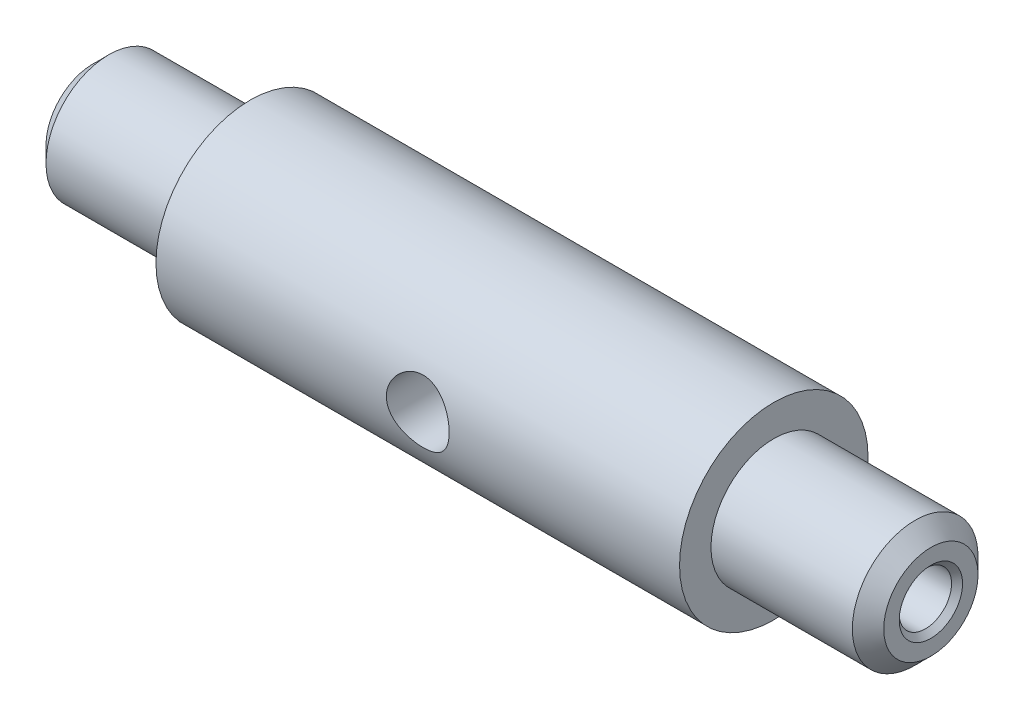
ISO-10303-21;
HEADER;
FILE_DESCRIPTION(('STEP AP214'),'2;1');
FILE_NAME('part.step','',(''),(''),'','','');
FILE_SCHEMA(('AUTOMOTIVE_DESIGN { 1 0 10303 214 1 1 1 1 }'));
ENDSEC;
DATA;
#1=APPLICATION_CONTEXT('core data for automotive mechanical design processes');
#2=APPLICATION_PROTOCOL_DEFINITION('international standard','automotive_design',2000,#1);
#3=PRODUCT_CONTEXT('',#1,'mechanical');
#4=PRODUCT('Part','Part','',(#3));
#5=PRODUCT_RELATED_PRODUCT_CATEGORY('part','',(#4));
#6=PRODUCT_DEFINITION_FORMATION('','',#4);
#7=PRODUCT_DEFINITION_CONTEXT('part definition',#1,'design');
#8=PRODUCT_DEFINITION('design','',#6,#7);
#9=PRODUCT_DEFINITION_SHAPE('','',#8);
#10=(LENGTH_UNIT() NAMED_UNIT(*) SI_UNIT(.MILLI.,.METRE.));
#11=(NAMED_UNIT(*) PLANE_ANGLE_UNIT() SI_UNIT($,.RADIAN.));
#12=(NAMED_UNIT(*) SI_UNIT($,.STERADIAN.) SOLID_ANGLE_UNIT());
#13=UNCERTAINTY_MEASURE_WITH_UNIT(LENGTH_MEASURE(1.E-05),#10,'distance_accuracy_value','');
#14=(GEOMETRIC_REPRESENTATION_CONTEXT(3) GLOBAL_UNCERTAINTY_ASSIGNED_CONTEXT((#13)) GLOBAL_UNIT_ASSIGNED_CONTEXT((#10,
#11,#12)) REPRESENTATION_CONTEXT('',''));
#15=CARTESIAN_POINT('',(0.,0.,0.));
#16=DIRECTION('',(0.,0.,1.));
#17=DIRECTION('',(1.,0.,0.));
#18=AXIS2_PLACEMENT_3D('',#15,#16,#17);
#19=CARTESIAN_POINT('',(0.,0.,-6.));
#20=DIRECTION('',(1.,0.,0.));
#21=DIRECTION('',(0.,0.,-1.));
#22=AXIS2_PLACEMENT_3D('',#19,#20,#21);
#23=PLANE('',#22);
#24=CARTESIAN_POINT('',(0.,0.,0.));
#25=DIRECTION('',(1.,0.,0.));
#26=DIRECTION('',(0.,0.,-1.));
#27=AXIS2_PLACEMENT_3D('',#24,#25,#26);
#28=CIRCLE('',#27,4.5);
#29=CARTESIAN_POINT('',(0.,0.,-4.5));
#30=VERTEX_POINT('',#29);
#31=EDGE_CURVE('E90',#30,#30,#28,.F.);
#32=ORIENTED_EDGE('',*,*,#31,.T.);
#33=EDGE_LOOP('',(#32));
#34=FACE_BOUND('',#33,.T.);
#35=ADVANCED_FACE('F50',(#34),#23,.F.);
#36=CARTESIAN_POINT('',(80.,0.,-6.));
#37=DIRECTION('',(-1.,0.,0.));
#38=DIRECTION('',(0.,0.,1.));
#39=AXIS2_PLACEMENT_3D('',#36,#37,#38);
#40=PLANE('',#39);
#41=CARTESIAN_POINT('',(80.,0.,0.));
#42=DIRECTION('',(-1.,0.,0.));
#43=DIRECTION('',(0.,0.,1.));
#44=AXIS2_PLACEMENT_3D('',#41,#42,#43);
#45=CIRCLE('',#44,4.5);
#46=CARTESIAN_POINT('',(80.,0.,4.5));
#47=VERTEX_POINT('',#46);
#48=EDGE_CURVE('E11',#47,#47,#45,.F.);
#49=ORIENTED_EDGE('',*,*,#48,.T.);
#50=EDGE_LOOP('',(#49));
#51=FACE_BOUND('',#50,.T.);
#52=CARTESIAN_POINT('',(80.,0.,0.));
#53=DIRECTION('',(1.,0.,0.));
#54=DIRECTION('',(0.,0.,-1.));
#55=AXIS2_PLACEMENT_3D('',#52,#53,#54);
#56=CIRCLE('',#55,3.025);
#57=CARTESIAN_POINT('',(80.,0.,-3.025));
#58=VERTEX_POINT('',#57);
#59=EDGE_CURVE('E78',#58,#58,#56,.T.);
#60=ORIENTED_EDGE('',*,*,#59,.F.);
#61=EDGE_LOOP('',(#60));
#62=FACE_BOUND('',#61,.T.);
#63=ADVANCED_FACE('F142',(#51,#62),#40,.F.);
#64=CARTESIAN_POINT('',(0.,0.,0.));
#65=DIRECTION('',(-1.,0.,0.));
#66=DIRECTION('',(0.,0.,1.));
#67=AXIS2_PLACEMENT_3D('',#64,#65,#66);
#68=CYLINDRICAL_SURFACE('',#67,6.);
#69=CARTESIAN_POINT('',(78.5,0.,0.));
#70=DIRECTION('',(-1.,0.,0.));
#71=DIRECTION('',(0.,0.,1.));
#72=AXIS2_PLACEMENT_3D('',#69,#70,#71);
#73=CIRCLE('',#72,6.);
#74=CARTESIAN_POINT('',(78.5,0.,6.));
#75=VERTEX_POINT('',#74);
#76=EDGE_CURVE('E58',#75,#75,#73,.T.);
#77=ORIENTED_EDGE('',*,*,#76,.T.);
#78=EDGE_LOOP('',(#77));
#79=FACE_BOUND('',#78,.T.);
#80=CARTESIAN_POINT('',(65.,0.,0.));
#81=DIRECTION('',(-1.,0.,0.));
#82=DIRECTION('',(0.,0.,1.));
#83=AXIS2_PLACEMENT_3D('',#80,#81,#82);
#84=CIRCLE('',#83,6.);
#85=CARTESIAN_POINT('',(65.,0.,6.));
#86=VERTEX_POINT('',#85);
#87=EDGE_CURVE('E87',#86,#86,#84,.T.);
#88=ORIENTED_EDGE('',*,*,#87,.F.);
#89=EDGE_LOOP('',(#88));
#90=FACE_BOUND('',#89,.T.);
#91=ADVANCED_FACE('F138',(#79,#90),#68,.T.);
#92=CARTESIAN_POINT('',(65.,0.,-9.));
#93=DIRECTION('',(-1.,0.,0.));
#94=DIRECTION('',(0.,0.,1.));
#95=AXIS2_PLACEMENT_3D('',#92,#93,#94);
#96=PLANE('',#95);
#97=CARTESIAN_POINT('',(65.,0.,0.));
#98=DIRECTION('',(-1.,0.,0.));
#99=DIRECTION('',(0.,0.,1.));
#100=AXIS2_PLACEMENT_3D('',#97,#98,#99);
#101=CIRCLE('',#100,9.);
#102=CARTESIAN_POINT('',(65.,0.,9.));
#103=VERTEX_POINT('',#102);
#104=EDGE_CURVE('E84',#103,#103,#101,.T.);
#105=ORIENTED_EDGE('',*,*,#104,.F.);
#106=EDGE_LOOP('',(#105));
#107=FACE_BOUND('',#106,.T.);
#108=ORIENTED_EDGE('',*,*,#87,.T.);
#109=EDGE_LOOP('',(#108));
#110=FACE_BOUND('',#109,.T.);
#111=ADVANCED_FACE('F132',(#107,#110),#96,.F.);
#112=CARTESIAN_POINT('',(0.,0.,0.));
#113=DIRECTION('',(-1.,0.,0.));
#114=DIRECTION('',(0.,0.,1.));
#115=AXIS2_PLACEMENT_3D('',#112,#113,#114);
#116=CYLINDRICAL_SURFACE('',#115,9.);
#117=CARTESIAN_POINT('',(43.,0.,-9.));
#118=CARTESIAN_POINT('',(43.0000007611949,0.16369008866017,-9.00000045902832));
#119=CARTESIAN_POINT('',(42.9865592016184,0.32737558361565,-8.99549308522634));
#120=CARTESIAN_POINT('',(42.9333126735484,0.649925282618917,-8.97795630609842));
#121=CARTESIAN_POINT('',(42.8935049681532,0.808788984356454,-8.96492601606458));
#122=CARTESIAN_POINT('',(42.7890422698479,1.11699836850533,-8.93175923719328));
#123=CARTESIAN_POINT('',(42.7244288126222,1.2663594776581,-8.9116346319256));
#124=CARTESIAN_POINT('',(42.572376481485,1.55212481041597,-8.86633337152025));
#125=CARTESIAN_POINT('',(42.4849331049922,1.68852647087612,-8.84115572003334));
#126=CARTESIAN_POINT('',(42.2865225854237,1.9492250250668,-8.78742283329015));
#127=CARTESIAN_POINT('',(42.1749062972185,2.07301110089493,-8.75878669391354));
#128=CARTESIAN_POINT('',(41.9326985358803,2.30049807810626,-8.70180944349364));
#129=CARTESIAN_POINT('',(41.8021028952145,2.40419455646839,-8.67346839871647));
#130=CARTESIAN_POINT('',(41.5210446544106,2.59147482668358,-8.61939997431821));
#131=CARTESIAN_POINT('',(41.3701187808036,2.6743945746631,-8.59377117827064));
#132=CARTESIAN_POINT('',(41.0554717166244,2.81345662163316,-8.54925916255803));
#133=CARTESIAN_POINT('',(40.8917544485118,2.8696070921603,-8.53037388482237));
#134=CARTESIAN_POINT('',(40.5619803355099,2.95162038452749,-8.50233909808132));
#135=CARTESIAN_POINT('',(40.3961883745328,2.97844034481531,-8.49288287308834));
#136=CARTESIAN_POINT('',(40.0622087375324,3.00402337000343,-8.48386969888522));
#137=CARTESIAN_POINT('',(39.8940218178724,3.00279510481416,-8.4843096906819));
#138=CARTESIAN_POINT('',(39.5681901086679,2.97305971111026,-8.4947704502454));
#139=CARTESIAN_POINT('',(39.4104147912429,2.94580173950099,-8.50435247602599));
#140=CARTESIAN_POINT('',(39.1018197411795,2.86681848854825,-8.53129973173653));
#141=CARTESIAN_POINT('',(38.9510008436948,2.81509027977562,-8.54866589352322));
#142=CARTESIAN_POINT('',(38.6577617512256,2.68781717418063,-8.58953733393746));
#143=CARTESIAN_POINT('',(38.5155159235914,2.61190214612179,-8.61313697379352));
#144=CARTESIAN_POINT('',(38.2453872751608,2.43866731890942,-8.66377675727179));
#145=CARTESIAN_POINT('',(38.1175086191999,2.34134133709202,-8.69081789371391));
#146=CARTESIAN_POINT('',(37.8727252055177,2.12204799804671,-8.74701987503222));
#147=CARTESIAN_POINT('',(37.7567419164728,1.99905945022893,-8.77621768064528));
#148=CARTESIAN_POINT('',(37.5468062000098,1.73501870991019,-8.8322081516111));
#149=CARTESIAN_POINT('',(37.4528558855065,1.59396478698244,-8.85900058614202));
#150=CARTESIAN_POINT('',(37.2889110992948,1.29584283913881,-8.90751323813381));
#151=CARTESIAN_POINT('',(37.2191635259778,1.13862982924901,-8.92918050024118));
#152=CARTESIAN_POINT('',(37.1073904781329,0.813807250093526,-8.96461701433304));
#153=CARTESIAN_POINT('',(37.0653553737297,0.646201314464864,-8.97838900964638));
#154=CARTESIAN_POINT('',(37.0118330019329,0.313151488587914,-8.99602881214321));
#155=CARTESIAN_POINT('',(36.9991005724817,0.14792879959454,-9.00030005501184));
#156=CARTESIAN_POINT('',(37.0009980207954,-0.182325209880712,-8.99966708084482));
#157=CARTESIAN_POINT('',(37.0156232799396,-0.347356557958952,-8.99476441258087));
#158=CARTESIAN_POINT('',(37.0708357232079,-0.667559598912768,-8.97660074151313));
#159=CARTESIAN_POINT('',(37.1106586181485,-0.822878420504531,-8.96358596133577));
#160=CARTESIAN_POINT('',(37.2141803334002,-1.12456787573872,-8.9307554049021));
#161=CARTESIAN_POINT('',(37.2778821984034,-1.27093736552582,-8.91093876140025));
#162=CARTESIAN_POINT('',(37.4292112955224,-1.55486488917982,-8.86586793861869));
#163=CARTESIAN_POINT('',(37.5174237798495,-1.69208987765144,-8.84048444267358));
#164=CARTESIAN_POINT('',(37.7145824500405,-1.95019449040676,-8.78715761748787));
#165=CARTESIAN_POINT('',(37.8235349680953,-2.07106910338673,-8.75921350781483));
#166=CARTESIAN_POINT('',(38.0649362530198,-2.2987575234189,-8.70230543941334));
#167=CARTESIAN_POINT('',(38.1982276807806,-2.40468290773731,-8.67335283262284));
#168=CARTESIAN_POINT('',(38.4813147034327,-2.59277256697072,-8.61899919884126));
#169=CARTESIAN_POINT('',(38.6311104359022,-2.67493664379304,-8.59359820146007));
#170=CARTESIAN_POINT('',(38.9430190458697,-2.81279079124909,-8.54947175374151));
#171=CARTESIAN_POINT('',(39.1051062375063,-2.86853439649507,-8.53073282378936));
#172=CARTESIAN_POINT('',(39.4371359501324,-2.95168400027807,-8.50232496919349));
#173=CARTESIAN_POINT('',(39.607074896213,-2.97910276486182,-8.49265195870918));
#174=CARTESIAN_POINT('',(39.9405912881227,-3.00382884743203,-8.48393576622531));
#175=CARTESIAN_POINT('',(40.1040470208605,-3.0026107719252,-8.48437200772245));
#176=CARTESIAN_POINT('',(40.4282952247662,-2.97372688034608,-8.49453809471602));
#177=CARTESIAN_POINT('',(40.5890878538653,-2.94606263837576,-8.50426738708085));
#178=CARTESIAN_POINT('',(40.9004069890074,-2.86611543938804,-8.53153572914675));
#179=CARTESIAN_POINT('',(41.0510704750135,-2.81431003804654,-8.54892294067433));
#180=CARTESIAN_POINT('',(41.3416822208148,-2.68793809727924,-8.58949196455405));
#181=CARTESIAN_POINT('',(41.481628093564,-2.61336650566142,-8.61267506290179));
#182=CARTESIAN_POINT('',(41.7534510097687,-2.43978207775029,-8.66348487678138));
#183=CARTESIAN_POINT('',(41.8847095056952,-2.33984472829374,-8.69126134926411));
#184=CARTESIAN_POINT('',(42.1290694401526,-2.11992864940694,-8.74750068849759));
#185=CARTESIAN_POINT('',(42.2421657270642,-1.99994425335444,-8.77596374737117));
#186=CARTESIAN_POINT('',(42.4514332368675,-1.73772467076207,-8.83170091576632));
#187=CARTESIAN_POINT('',(42.546773043253,-1.59480454049919,-8.8588854540377));
#188=CARTESIAN_POINT('',(42.7119712865519,-1.29407207221988,-8.90777973517836));
#189=CARTESIAN_POINT('',(42.7818362377661,-1.13626355439705,-8.92949087723789));
#190=CARTESIAN_POINT('',(42.891164897466,-0.817480941602931,-8.96416545205625));
#191=CARTESIAN_POINT('',(42.9318473987901,-0.656963273029229,-8.97747637267568));
#192=CARTESIAN_POINT('',(42.9862608420314,-0.330961248030742,-8.99539221192665));
#193=CARTESIAN_POINT('',(42.9999992304896,-0.16547827670624,-8.99999953595715));
#194=CARTESIAN_POINT('',(43.,0.,-9.));
#195=B_SPLINE_CURVE_WITH_KNOTS('',3,(#117,#118,#119,#120,#121,#122,#123,#124,#125,#126,#127,
#128,#129,#130,#131,#132,#133,#134,#135,#136,#137,#138,#139,#140,#141,#142,#143,#144,#145,#146,
#147,#148,#149,#150,#151,#152,#153,#154,#155,#156,#157,#158,#159,#160,#161,#162,#163,#164,#165,
#166,#167,#168,#169,#170,#171,#172,#173,#174,#175,#176,#177,#178,#179,#180,#181,#182,#183,#184,
#185,#186,#187,#188,#189,#190,#191,#192,#193,#194),.UNSPECIFIED.,.T.,.F.,(4,2,2,2,2,2,2,2,2,2,2,
2,2,2,2,2,2,2,2,2,2,2,2,2,2,2,2,2,2,2,2,2,2,2,2,2,2,2,4),(0.,0.490461318078033,
0.980973555802562,1.47066801861082,1.9604591333973,2.46554052848269,2.97073299862591,
3.49045154470411,4.010011340785,4.51205777225521,5.01394901962457,5.49290479653841,
5.97191792566446,6.45864513465392,6.94551307674622,7.45779917434101,7.97013437899855,
8.48755216951072,9.00479006631625,9.49960749525509,9.9943413949253,10.4747447393464,
10.9552093585231,11.4483119953121,11.9415654246567,12.4572306864226,12.9729002470499,
13.4875204148031,14.0019085411752,14.4898699819277,14.9778023805413,15.4564676124125,
15.9352391452793,16.4349020007541,16.9347063337134,17.453989825053,17.9731404345737,
18.4690967512144,18.9649159811442),.UNSPECIFIED.);
#196=CARTESIAN_POINT('',(43.,0.,-9.));
#197=VERTEX_POINT('',#196);
#198=EDGE_CURVE('E122',#197,#197,#195,.T.);
#199=ORIENTED_EDGE('',*,*,#198,.T.);
#200=EDGE_LOOP('',(#199));
#201=FACE_BOUND('',#200,.T.);
#202=CARTESIAN_POINT('',(43.,0.,9.));
#203=CARTESIAN_POINT('',(43.0000007611949,-0.16369008866017,9.00000045902832));
#204=CARTESIAN_POINT('',(42.9865592016184,-0.32737558361565,8.99549308522634));
#205=CARTESIAN_POINT('',(42.9333126735484,-0.649925282618917,8.97795630609842));
#206=CARTESIAN_POINT('',(42.8935049681532,-0.808788984356454,8.96492601606458));
#207=CARTESIAN_POINT('',(42.7890422698479,-1.11699836850533,8.93175923719328));
#208=CARTESIAN_POINT('',(42.7244288126222,-1.2663594776581,8.9116346319256));
#209=CARTESIAN_POINT('',(42.572376481485,-1.55212481041597,8.86633337152025));
#210=CARTESIAN_POINT('',(42.4849331049922,-1.68852647087612,8.84115572003334));
#211=CARTESIAN_POINT('',(42.2865225854237,-1.9492250250668,8.78742283329015));
#212=CARTESIAN_POINT('',(42.1749062972185,-2.07301110089493,8.75878669391354));
#213=CARTESIAN_POINT('',(41.9326985358803,-2.30049807810626,8.70180944349364));
#214=CARTESIAN_POINT('',(41.8021028952145,-2.40419455646839,8.67346839871647));
#215=CARTESIAN_POINT('',(41.5210446544106,-2.59147482668358,8.61939997431821));
#216=CARTESIAN_POINT('',(41.3701187808036,-2.6743945746631,8.59377117827064));
#217=CARTESIAN_POINT('',(41.0554717166244,-2.81345662163316,8.54925916255803));
#218=CARTESIAN_POINT('',(40.8917544485118,-2.8696070921603,8.53037388482237));
#219=CARTESIAN_POINT('',(40.5619803355099,-2.95162038452749,8.50233909808132));
#220=CARTESIAN_POINT('',(40.3961883745328,-2.97844034481531,8.49288287308834));
#221=CARTESIAN_POINT('',(40.0622087375324,-3.00402337000343,8.48386969888522));
#222=CARTESIAN_POINT('',(39.8940218178724,-3.00279510481416,8.4843096906819));
#223=CARTESIAN_POINT('',(39.5681901086679,-2.97305971111026,8.4947704502454));
#224=CARTESIAN_POINT('',(39.4104147912429,-2.94580173950099,8.50435247602599));
#225=CARTESIAN_POINT('',(39.1018197411795,-2.86681848854825,8.53129973173653));
#226=CARTESIAN_POINT('',(38.9510008436948,-2.81509027977562,8.54866589352322));
#227=CARTESIAN_POINT('',(38.6577617512256,-2.68781717418063,8.58953733393746));
#228=CARTESIAN_POINT('',(38.5155159235914,-2.61190214612179,8.61313697379352));
#229=CARTESIAN_POINT('',(38.2453872751608,-2.43866731890942,8.66377675727179));
#230=CARTESIAN_POINT('',(38.1175086191999,-2.34134133709202,8.69081789371391));
#231=CARTESIAN_POINT('',(37.8727252055177,-2.12204799804671,8.74701987503222));
#232=CARTESIAN_POINT('',(37.7567419164728,-1.99905945022893,8.77621768064528));
#233=CARTESIAN_POINT('',(37.5468062000098,-1.73501870991019,8.8322081516111));
#234=CARTESIAN_POINT('',(37.4528558855065,-1.59396478698244,8.85900058614202));
#235=CARTESIAN_POINT('',(37.2889110992948,-1.29584283913881,8.90751323813381));
#236=CARTESIAN_POINT('',(37.2191635259778,-1.13862982924901,8.92918050024118));
#237=CARTESIAN_POINT('',(37.1073904781329,-0.813807250093526,8.96461701433304));
#238=CARTESIAN_POINT('',(37.0653553737297,-0.646201314464864,8.97838900964638));
#239=CARTESIAN_POINT('',(37.0118330019329,-0.313151488587914,8.99602881214321));
#240=CARTESIAN_POINT('',(36.9991005724817,-0.14792879959454,9.00030005501184));
#241=CARTESIAN_POINT('',(37.0009980207954,0.182325209880712,8.99966708084482));
#242=CARTESIAN_POINT('',(37.0156232799396,0.347356557958952,8.99476441258087));
#243=CARTESIAN_POINT('',(37.0708357232079,0.667559598912768,8.97660074151313));
#244=CARTESIAN_POINT('',(37.1106586181485,0.822878420504531,8.96358596133577));
#245=CARTESIAN_POINT('',(37.2141803334002,1.12456787573872,8.9307554049021));
#246=CARTESIAN_POINT('',(37.2778821984034,1.27093736552582,8.91093876140025));
#247=CARTESIAN_POINT('',(37.4292112955224,1.55486488917982,8.86586793861869));
#248=CARTESIAN_POINT('',(37.5174237798495,1.69208987765144,8.84048444267358));
#249=CARTESIAN_POINT('',(37.7145824500405,1.95019449040676,8.78715761748787));
#250=CARTESIAN_POINT('',(37.8235349680953,2.07106910338673,8.75921350781483));
#251=CARTESIAN_POINT('',(38.0649362530198,2.2987575234189,8.70230543941334));
#252=CARTESIAN_POINT('',(38.1982276807806,2.40468290773731,8.67335283262284));
#253=CARTESIAN_POINT('',(38.4813147034327,2.59277256697072,8.61899919884126));
#254=CARTESIAN_POINT('',(38.6311104359022,2.67493664379304,8.59359820146007));
#255=CARTESIAN_POINT('',(38.9430190458697,2.81279079124909,8.54947175374151));
#256=CARTESIAN_POINT('',(39.1051062375063,2.86853439649507,8.53073282378936));
#257=CARTESIAN_POINT('',(39.4371359501324,2.95168400027807,8.50232496919349));
#258=CARTESIAN_POINT('',(39.607074896213,2.97910276486182,8.49265195870918));
#259=CARTESIAN_POINT('',(39.9405912881227,3.00382884743203,8.48393576622531));
#260=CARTESIAN_POINT('',(40.1040470208605,3.0026107719252,8.48437200772245));
#261=CARTESIAN_POINT('',(40.4282952247662,2.97372688034608,8.49453809471602));
#262=CARTESIAN_POINT('',(40.5890878538653,2.94606263837576,8.50426738708085));
#263=CARTESIAN_POINT('',(40.9004069890074,2.86611543938804,8.53153572914675));
#264=CARTESIAN_POINT('',(41.0510704750135,2.81431003804654,8.54892294067433));
#265=CARTESIAN_POINT('',(41.3416822208148,2.68793809727924,8.58949196455405));
#266=CARTESIAN_POINT('',(41.481628093564,2.61336650566142,8.61267506290179));
#267=CARTESIAN_POINT('',(41.7534510097687,2.43978207775029,8.66348487678138));
#268=CARTESIAN_POINT('',(41.8847095056952,2.33984472829374,8.69126134926411));
#269=CARTESIAN_POINT('',(42.1290694401526,2.11992864940694,8.74750068849759));
#270=CARTESIAN_POINT('',(42.2421657270642,1.99994425335444,8.77596374737117));
#271=CARTESIAN_POINT('',(42.4514332368675,1.73772467076207,8.83170091576632));
#272=CARTESIAN_POINT('',(42.546773043253,1.59480454049919,8.8588854540377));
#273=CARTESIAN_POINT('',(42.7119712865519,1.29407207221988,8.90777973517836));
#274=CARTESIAN_POINT('',(42.7818362377661,1.13626355439705,8.92949087723789));
#275=CARTESIAN_POINT('',(42.891164897466,0.817480941602931,8.96416545205625));
#276=CARTESIAN_POINT('',(42.9318473987901,0.656963273029229,8.97747637267568));
#277=CARTESIAN_POINT('',(42.9862608420314,0.330961248030742,8.99539221192665));
#278=CARTESIAN_POINT('',(42.9999992304896,0.16547827670624,8.99999953595715));
#279=CARTESIAN_POINT('',(43.,0.,9.));
#280=B_SPLINE_CURVE_WITH_KNOTS('',3,(#202,#203,#204,#205,#206,#207,#208,#209,#210,#211,#212,
#213,#214,#215,#216,#217,#218,#219,#220,#221,#222,#223,#224,#225,#226,#227,#228,#229,#230,#231,
#232,#233,#234,#235,#236,#237,#238,#239,#240,#241,#242,#243,#244,#245,#246,#247,#248,#249,#250,
#251,#252,#253,#254,#255,#256,#257,#258,#259,#260,#261,#262,#263,#264,#265,#266,#267,#268,#269,
#270,#271,#272,#273,#274,#275,#276,#277,#278,#279),.UNSPECIFIED.,.T.,.F.,(4,2,2,2,2,2,2,2,2,2,2,
2,2,2,2,2,2,2,2,2,2,2,2,2,2,2,2,2,2,2,2,2,2,2,2,2,2,2,4),(0.,0.490461318078033,
0.980973555802562,1.47066801861082,1.9604591333973,2.46554052848269,2.97073299862591,
3.49045154470411,4.010011340785,4.51205777225521,5.01394901962457,5.49290479653841,
5.97191792566446,6.45864513465392,6.94551307674622,7.45779917434101,7.97013437899855,
8.48755216951072,9.00479006631625,9.49960749525509,9.9943413949253,10.4747447393464,
10.9552093585231,11.4483119953121,11.9415654246567,12.4572306864226,12.9729002470499,
13.4875204148031,14.0019085411752,14.4898699819277,14.9778023805413,15.4564676124125,
15.9352391452793,16.4349020007541,16.9347063337134,17.453989825053,17.9731404345737,
18.4690967512144,18.9649159811442),.UNSPECIFIED.);
#281=CARTESIAN_POINT('',(43.,0.,9.));
#282=VERTEX_POINT('',#281);
#283=EDGE_CURVE('E116',#282,#282,#280,.T.);
#284=ORIENTED_EDGE('',*,*,#283,.T.);
#285=EDGE_LOOP('',(#284));
#286=FACE_BOUND('',#285,.T.);
#287=CARTESIAN_POINT('',(15.,0.,0.));
#288=DIRECTION('',(-1.,0.,0.));
#289=DIRECTION('',(0.,0.,1.));
#290=AXIS2_PLACEMENT_3D('',#287,#288,#289);
#291=CIRCLE('',#290,9.);
#292=CARTESIAN_POINT('',(15.,0.,9.));
#293=VERTEX_POINT('',#292);
#294=EDGE_CURVE('E75',#293,#293,#291,.T.);
#295=ORIENTED_EDGE('',*,*,#294,.F.);
#296=EDGE_LOOP('',(#295));
#297=FACE_BOUND('',#296,.T.);
#298=ORIENTED_EDGE('',*,*,#104,.T.);
#299=EDGE_LOOP('',(#298));
#300=FACE_BOUND('',#299,.T.);
#301=ADVANCED_FACE('F126',(#201,#286,#297,#300),#116,.T.);
#302=CARTESIAN_POINT('',(15.,0.,-6.));
#303=DIRECTION('',(1.,0.,0.));
#304=DIRECTION('',(0.,0.,-1.));
#305=AXIS2_PLACEMENT_3D('',#302,#303,#304);
#306=PLANE('',#305);
#307=CARTESIAN_POINT('',(15.,0.,0.));
#308=DIRECTION('',(-1.,0.,0.));
#309=DIRECTION('',(0.,0.,1.));
#310=AXIS2_PLACEMENT_3D('',#307,#308,#309);
#311=CIRCLE('',#310,6.);
#312=CARTESIAN_POINT('',(15.,0.,6.));
#313=VERTEX_POINT('',#312);
#314=EDGE_CURVE('E71',#313,#313,#311,.T.);
#315=ORIENTED_EDGE('',*,*,#314,.F.);
#316=EDGE_LOOP('',(#315));
#317=FACE_BOUND('',#316,.T.);
#318=ORIENTED_EDGE('',*,*,#294,.T.);
#319=EDGE_LOOP('',(#318));
#320=FACE_BOUND('',#319,.T.);
#321=ADVANCED_FACE('F131',(#317,#320),#306,.F.);
#322=CARTESIAN_POINT('',(0.,0.,0.));
#323=DIRECTION('',(-1.,0.,0.));
#324=DIRECTION('',(0.,0.,1.));
#325=AXIS2_PLACEMENT_3D('',#322,#323,#324);
#326=CYLINDRICAL_SURFACE('',#325,6.);
#327=CARTESIAN_POINT('',(1.50000000000002,0.,0.));
#328=DIRECTION('',(1.,0.,0.));
#329=DIRECTION('',(0.,0.,-1.));
#330=AXIS2_PLACEMENT_3D('',#327,#328,#329);
#331=CIRCLE('',#330,6.);
#332=CARTESIAN_POINT('',(1.50000000000002,0.,-6.));
#333=VERTEX_POINT('',#332);
#334=EDGE_CURVE('E164',#333,#333,#331,.T.);
#335=ORIENTED_EDGE('',*,*,#334,.T.);
#336=EDGE_LOOP('',(#335));
#337=FACE_BOUND('',#336,.T.);
#338=ORIENTED_EDGE('',*,*,#314,.T.);
#339=EDGE_LOOP('',(#338));
#340=FACE_BOUND('',#339,.T.);
#341=ADVANCED_FACE('F175',(#337,#340),#326,.T.);
#342=CARTESIAN_POINT('',(80.,0.,0.));
#343=DIRECTION('',(1.,0.,0.));
#344=DIRECTION('',(0.,0.,-1.));
#345=AXIS2_PLACEMENT_3D('',#342,#343,#344);
#346=CYLINDRICAL_SURFACE('',#345,2.5);
#347=CARTESIAN_POINT('',(43.,0.,-2.5));
#348=CARTESIAN_POINT('',(42.9999952279521,-0.118757533193203,-2.49999511444631));
#349=CARTESIAN_POINT('',(42.9928867059474,-0.237551281104127,-2.49147749609542));
#350=CARTESIAN_POINT('',(42.9651076286827,-0.47118249249281,-2.45803727664816));
#351=CARTESIAN_POINT('',(42.9444270294201,-0.586016959612417,-2.43310252602469));
#352=CARTESIAN_POINT('',(42.8914269023887,-0.807829942407296,-2.36868788266729));
#353=CARTESIAN_POINT('',(42.8591769655007,-0.914850920904899,-2.32929492564628));
#354=CARTESIAN_POINT('',(42.785291761829,-1.11984139043408,-2.23798295205742));
#355=CARTESIAN_POINT('',(42.7436533243494,-1.21780780775233,-2.18605970332675));
#356=CARTESIAN_POINT('',(42.6367419152987,-1.43789998519767,-2.05054625019184));
#357=CARTESIAN_POINT('',(42.5684054925619,-1.5556821965722,-1.96232979581782));
#358=CARTESIAN_POINT('',(42.4242262477767,-1.77202398328146,-1.76947567424863));
#359=CARTESIAN_POINT('',(42.3483628145328,-1.87052845158604,-1.66479243075689));
#360=CARTESIAN_POINT('',(42.2329488631374,-2.00437263805588,-1.4959157235089));
#361=CARTESIAN_POINT('',(42.19383679995,-2.04699726278815,-1.43704442380869));
#362=CARTESIAN_POINT('',(42.1162061180919,-2.12715295529554,-1.31549439703949));
#363=CARTESIAN_POINT('',(42.0776877019502,-2.16468231743739,-1.25281440512925));
#364=CARTESIAN_POINT('',(42.0025054328866,-2.23441122570746,-1.12373267566438));
#365=CARTESIAN_POINT('',(41.9658373575465,-2.26662332666226,-1.05734021527518));
#366=CARTESIAN_POINT('',(41.8957768663031,-2.32553690612792,-0.920553716071604));
#367=CARTESIAN_POINT('',(41.862381672209,-2.3522430799868,-0.850163152658202));
#368=CARTESIAN_POINT('',(41.7979191898041,-2.40193513934005,-0.698332909799898));
#369=CARTESIAN_POINT('',(41.76736311251,-2.42433807692598,-0.616475907276517));
#370=CARTESIAN_POINT('',(41.71593180556,-2.46101313675502,-0.448110231186896));
#371=CARTESIAN_POINT('',(41.695033101942,-2.47530499393792,-0.361613413385324));
#372=CARTESIAN_POINT('',(41.6662092896885,-2.49481072799047,-0.184234591620543));
#373=CARTESIAN_POINT('',(41.6584451056309,-2.49991205058667,-0.0933120409293055));
#374=CARTESIAN_POINT('',(41.6581830853183,-2.50008569371189,0.0885626130027642));
#375=CARTESIAN_POINT('',(41.6656854491694,-2.49515788278404,0.179514716615338));
#376=CARTESIAN_POINT('',(41.695416394645,-2.47505262029594,0.365524710827123));
#377=CARTESIAN_POINT('',(41.7188193206647,-2.45905577113331,0.460293745717067));
#378=CARTESIAN_POINT('',(41.7768823573891,-2.41742550503026,0.644210981202177));
#379=CARTESIAN_POINT('',(41.8115797710303,-2.39176011044289,0.733339370714825));
#380=CARTESIAN_POINT('',(41.8800222612614,-2.33816270346872,0.887827078541109));
#381=CARTESIAN_POINT('',(41.9125031684544,-2.31177513033565,0.95431224241166));
#382=CARTESIAN_POINT('',(41.9802199666153,-2.25404424958635,1.08365080677994));
#383=CARTESIAN_POINT('',(42.0154574669779,-2.22269803586305,1.14650204786585));
#384=CARTESIAN_POINT('',(42.1234264810973,-2.12149677560465,1.32996684101968));
#385=CARTESIAN_POINT('',(42.1983769696744,-2.04450664231775,1.44541414760609));
#386=CARTESIAN_POINT('',(42.3507989795228,-1.86765914501413,1.66826696245436));
#387=CARTESIAN_POINT('',(42.4281979261895,-1.76681805277627,1.77493832399189));
#388=CARTESIAN_POINT('',(42.5750905404329,-1.54484388336147,1.97111234481741));
#389=CARTESIAN_POINT('',(42.6446011226737,-1.42375565615771,2.06065203305627));
#390=CARTESIAN_POINT('',(42.7542891412655,-1.19411179169414,2.19941483909855));
#391=CARTESIAN_POINT('',(42.79748350074,-1.08972732107275,2.25314289818765));
#392=CARTESIAN_POINT('',(42.873078040198,-0.871071458330349,2.34634274525534));
#393=CARTESIAN_POINT('',(42.9054849566081,-0.756806292780747,2.38582343158057));
#394=CARTESIAN_POINT('',(42.9570983426557,-0.519954301215404,2.4484172499322));
#395=CARTESIAN_POINT('',(42.9762028095584,-0.397310923125295,2.47140394665756));
#396=CARTESIAN_POINT('',(42.9989143452897,-0.148559976923715,2.49870923192718));
#397=CARTESIAN_POINT('',(43.0025317830418,-0.0224547835239901,2.50304031085015));
#398=CARTESIAN_POINT('',(42.9944499903915,0.213310199456585,2.49333756055623));
#399=CARTESIAN_POINT('',(42.9845335071631,0.323130540835869,2.48144136128483));
#400=CARTESIAN_POINT('',(42.9532558946014,0.538644964400614,2.4437330497885));
#401=CARTESIAN_POINT('',(42.931893392428,0.64433854998957,2.41791926828103));
#402=CARTESIAN_POINT('',(42.8788952154619,0.850565499199264,2.35337660454474));
#403=CARTESIAN_POINT('',(42.8471256489197,0.951010682223324,2.31447921055572));
#404=CARTESIAN_POINT('',(42.7753612473389,1.14365900898104,2.22560436766329));
#405=CARTESIAN_POINT('',(42.7353633722181,1.23585908831211,2.1756228230067));
#406=CARTESIAN_POINT('',(42.6297515215859,1.450674397351,2.04156820465302));
#407=CARTESIAN_POINT('',(42.5607024423471,1.56834359540732,1.95226741673268));
#408=CARTESIAN_POINT('',(42.4152244540319,1.78428994740848,1.75715961734435));
#409=CARTESIAN_POINT('',(42.3387730042283,1.88250490855173,1.65130154464524));
#410=CARTESIAN_POINT('',(42.222698055986,2.01573314784291,1.48058803207137));
#411=CARTESIAN_POINT('',(42.1834115173603,2.05811069143949,1.421101727024));
#412=CARTESIAN_POINT('',(42.1055315381718,2.13771669597406,1.29827918396771));
#413=CARTESIAN_POINT('',(42.0669383513361,2.17494330406755,1.23494157233589));
#414=CARTESIAN_POINT('',(41.9917610848264,2.24398857026758,1.10451159608479));
#415=CARTESIAN_POINT('',(41.9551718863421,2.27582148781538,1.03742977546638));
#416=CARTESIAN_POINT('',(41.8854756144818,2.3338885673946,0.899209895500154));
#417=CARTESIAN_POINT('',(41.8523653645079,2.36012785984655,0.828075629580612));
#418=CARTESIAN_POINT('',(41.7892555741605,2.40837357148322,0.675729631648096));
#419=CARTESIAN_POINT('',(41.7597071178665,2.42988314318544,0.594165548926257));
#420=CARTESIAN_POINT('',(41.7104306388743,2.46482255689514,0.426548046057378));
#421=CARTESIAN_POINT('',(41.6906781122526,2.47827257713356,0.340506428672104));
#422=CARTESIAN_POINT('',(41.6641531597946,2.49617289535263,0.164362392587653));
#423=CARTESIAN_POINT('',(41.6575325104839,2.5005179918396,0.0742246702492974));
#424=CARTESIAN_POINT('',(41.6592430863067,2.49938197104455,-0.105853212783953));
#425=CARTESIAN_POINT('',(41.6675782540216,2.49389826274011,-0.195793315125153));
#426=CARTESIAN_POINT('',(41.6989289873552,2.4726526384854,-0.381672575390537));
#427=CARTESIAN_POINT('',(41.7234137102386,2.4558581255076,-0.477230270532696));
#428=CARTESIAN_POINT('',(41.7835872803739,2.4125033967509,-0.662531296082725));
#429=CARTESIAN_POINT('',(41.8193131253133,2.38591088285908,-0.752254228709316));
#430=CARTESIAN_POINT('',(41.889526193662,2.33050835844918,-0.907789041354861));
#431=CARTESIAN_POINT('',(41.9227781662779,2.3032585304953,-0.974743759234942));
#432=CARTESIAN_POINT('',(41.9919518523057,2.24370627018011,-1.10494638642442));
#433=CARTESIAN_POINT('',(42.0278751115052,2.21140090020862,-1.16819211099984));
#434=CARTESIAN_POINT('',(42.1377593116791,2.10716294428983,-1.35272956134198));
#435=CARTESIAN_POINT('',(42.2137978016432,2.02793576743749,-1.46874692499196));
#436=CARTESIAN_POINT('',(42.3677260376355,1.84629697567411,-1.69200726129127));
#437=CARTESIAN_POINT('',(42.4455239442951,1.74293959593278,-1.79854179403294));
#438=CARTESIAN_POINT('',(42.5925649842776,1.51553554935618,-1.99386379953936));
#439=CARTESIAN_POINT('',(42.6618269254307,1.39153583663212,-2.08269056587397));
#440=CARTESIAN_POINT('',(42.7694230578151,1.1585551814108,-2.21831419672311));
#441=CARTESIAN_POINT('',(42.8111217400688,1.0539987794769,-2.27003851021945));
#442=CARTESIAN_POINT('',(42.8836146066645,0.835439786054323,-2.35921867023858));
#443=CARTESIAN_POINT('',(42.9144233132377,0.72145002675387,-2.3966935240953));
#444=CARTESIAN_POINT('',(42.9585874590469,0.506620038886831,-2.45018845582659));
#445=CARTESIAN_POINT('',(42.9740214239811,0.406845468761902,-2.46877512222677));
#446=CARTESIAN_POINT('',(42.9947292279441,0.204722725654226,-2.49368236823808));
#447=CARTESIAN_POINT('',(43.0000041137394,0.102374818922779,-2.50000421158692));
#448=CARTESIAN_POINT('',(43.,0.,-2.5));
#449=B_SPLINE_CURVE_WITH_KNOTS('',3,(#347,#348,#349,#350,#351,#352,#353,#354,#355,#356,#357,
#358,#359,#360,#361,#362,#363,#364,#365,#366,#367,#368,#369,#370,#371,#372,#373,#374,#375,#376,
#377,#378,#379,#380,#381,#382,#383,#384,#385,#386,#387,#388,#389,#390,#391,#392,#393,#394,#395,
#396,#397,#398,#399,#400,#401,#402,#403,#404,#405,#406,#407,#408,#409,#410,#411,#412,#413,#414,
#415,#416,#417,#418,#419,#420,#421,#422,#423,#424,#425,#426,#427,#428,#429,#430,#431,#432,#433,
#434,#435,#436,#437,#438,#439,#440,#441,#442,#443,#444,#445,#446,#447,#448),.UNSPECIFIED.,.T.,
.F.,(4,2,2,2,2,2,2,2,2,2,2,2,2,2,2,2,2,2,2,2,2,2,2,2,2,2,2,2,2,2,2,2,2,2,2,2,2,2,2,2,2,2,2,2,2,
2,2,2,2,2,4),(0.,0.355841276815113,0.71194619102696,1.0659440535955,1.42006164830116,
1.90425178760126,2.38980643116774,2.63722280423449,2.88472179650724,3.13162777943676,
3.37832232674673,3.64812890035754,3.91727616616869,4.18969776924974,4.46212294312047,
4.75723524199721,5.05333228584568,5.28870178855694,5.52420974868633,5.99549339358981,
6.49137310548271,6.98616858956867,7.36002155957576,7.73364063000475,8.1100939531972,
8.4862951927436,8.81743460677925,9.14861374669871,9.48423297747606,9.81997643164433,
10.3065635514456,10.7946819775667,11.0432812121088,11.2919696391639,11.5399899810636,
11.787781852862,12.0551105531685,12.3217671309317,12.5914881373799,12.8612802568451,
13.1598101383752,13.4593330283462,13.6977271411687,13.9362602949129,14.4135864576438,
14.914300110886,15.413889999571,15.7841228897598,16.1538601797496,16.4606444271243,
16.7673970625123),.UNSPECIFIED.);
#450=CARTESIAN_POINT('',(43.,0.,-2.5));
#451=VERTEX_POINT('',#450);
#452=EDGE_CURVE('E91',#451,#451,#449,.T.);
#453=ORIENTED_EDGE('',*,*,#452,.T.);
#454=EDGE_LOOP('',(#453));
#455=FACE_BOUND('',#454,.T.);
#456=CARTESIAN_POINT('',(79.475,0.,0.));
#457=DIRECTION('',(1.,0.,0.));
#458=DIRECTION('',(0.,0.,-1.));
#459=AXIS2_PLACEMENT_3D('',#456,#457,#458);
#460=CIRCLE('',#459,2.5);
#461=CARTESIAN_POINT('',(79.475,0.,-2.5));
#462=VERTEX_POINT('',#461);
#463=EDGE_CURVE('E72',#462,#462,#460,.T.);
#464=ORIENTED_EDGE('',*,*,#463,.T.);
#465=EDGE_LOOP('',(#464));
#466=FACE_BOUND('',#465,.T.);
#467=ADVANCED_FACE('F104',(#455,#466),#346,.F.);
#468=CARTESIAN_POINT('',(80.,0.,0.));
#469=DIRECTION('',(1.,0.,0.));
#470=DIRECTION('',(0.,0.,-1.));
#471=AXIS2_PLACEMENT_3D('',#468,#469,#470);
#472=CONICAL_SURFACE('',#471,3.025,0.785398163397452);
#473=ORIENTED_EDGE('',*,*,#463,.F.);
#474=EDGE_LOOP('',(#473));
#475=FACE_BOUND('',#474,.T.);
#476=ORIENTED_EDGE('',*,*,#59,.T.);
#477=EDGE_LOOP('',(#476));
#478=FACE_BOUND('',#477,.T.);
#479=ADVANCED_FACE('F109',(#475,#478),#472,.F.);
#480=CARTESIAN_POINT('',(40.,0.,-9.));
#481=DIRECTION('',(0.,0.,1.));
#482=DIRECTION('',(1.,0.,0.));
#483=AXIS2_PLACEMENT_3D('',#480,#481,#482);
#484=CYLINDRICAL_SURFACE('',#483,3.);
#485=ORIENTED_EDGE('',*,*,#452,.F.);
#486=EDGE_LOOP('',(#485));
#487=FACE_BOUND('',#486,.T.);
#488=CARTESIAN_POINT('',(37.,0.,-2.5));
#489=CARTESIAN_POINT('',(37.000004772048,0.118757533193203,-2.49999511444631));
#490=CARTESIAN_POINT('',(37.0071132940526,0.237551281104127,-2.49147749609542));
#491=CARTESIAN_POINT('',(37.0348923713173,0.47118249249281,-2.45803727664816));
#492=CARTESIAN_POINT('',(37.0555729705799,0.586016959612416,-2.43310252602469));
#493=CARTESIAN_POINT('',(37.1085730976113,0.807829942407297,-2.36868788266729));
#494=CARTESIAN_POINT('',(37.1408230344993,0.914850920904901,-2.32929492564628));
#495=CARTESIAN_POINT('',(37.214708238171,1.11984139043408,-2.23798295205742));
#496=CARTESIAN_POINT('',(37.2563466756506,1.21780780775233,-2.18605970332675));
#497=CARTESIAN_POINT('',(37.3632580847013,1.43789998519767,-2.05054625019184));
#498=CARTESIAN_POINT('',(37.4315945074381,1.5556821965722,-1.96232979581782));
#499=CARTESIAN_POINT('',(37.5757737522233,1.77202398328146,-1.76947567424863));
#500=CARTESIAN_POINT('',(37.6516371854672,1.87052845158604,-1.66479243075689));
#501=CARTESIAN_POINT('',(37.7670511368626,2.00437263805588,-1.49591572350891));
#502=CARTESIAN_POINT('',(37.80616320005,2.04699726278815,-1.4370444238087));
#503=CARTESIAN_POINT('',(37.8837938819081,2.12715295529554,-1.31549439703949));
#504=CARTESIAN_POINT('',(37.9223122980498,2.16468231743739,-1.25281440512925));
#505=CARTESIAN_POINT('',(37.9974945671134,2.23441122570746,-1.12373267566438));
#506=CARTESIAN_POINT('',(38.0341626424535,2.26662332666226,-1.05734021527518));
#507=CARTESIAN_POINT('',(38.1042231336969,2.32553690612792,-0.920553716071604));
#508=CARTESIAN_POINT('',(38.137618327791,2.3522430799868,-0.850163152658202));
#509=CARTESIAN_POINT('',(38.2020808101959,2.40193513934005,-0.698332909799896));
#510=CARTESIAN_POINT('',(38.23263688749,2.42433807692598,-0.616475907276513));
#511=CARTESIAN_POINT('',(38.28406819444,2.46101313675502,-0.448110231186892));
#512=CARTESIAN_POINT('',(38.304966898058,2.47530499393792,-0.361613413385322));
#513=CARTESIAN_POINT('',(38.3337907103116,2.49481072799047,-0.184234591620543));
#514=CARTESIAN_POINT('',(38.3415548943691,2.49991205058667,-0.0933120409293055));
#515=CARTESIAN_POINT('',(38.3418169146817,2.50008569371189,0.0885626130027642));
#516=CARTESIAN_POINT('',(38.3343145508306,2.49515788278404,0.179514716615338));
#517=CARTESIAN_POINT('',(38.304583605355,2.47505262029594,0.365524710827124));
#518=CARTESIAN_POINT('',(38.2811806793353,2.45905577113331,0.460293745717068));
#519=CARTESIAN_POINT('',(38.2231176426109,2.41742550503026,0.644210981202179));
#520=CARTESIAN_POINT('',(38.1884202289697,2.39176011044289,0.733339370714826));
#521=CARTESIAN_POINT('',(38.1199777387386,2.33816270346872,0.887827078541108));
#522=CARTESIAN_POINT('',(38.0874968315456,2.31177513033565,0.954312242411658));
#523=CARTESIAN_POINT('',(38.0197800333847,2.25404424958635,1.08365080677994));
#524=CARTESIAN_POINT('',(37.9845425330221,2.22269803586305,1.14650204786585));
#525=CARTESIAN_POINT('',(37.8765735189027,2.12149677560465,1.32996684101968));
#526=CARTESIAN_POINT('',(37.8016230303256,2.04450664231775,1.44541414760609));
#527=CARTESIAN_POINT('',(37.6492010204772,1.86765914501413,1.66826696245436));
#528=CARTESIAN_POINT('',(37.5718020738105,1.76681805277627,1.77493832399189));
#529=CARTESIAN_POINT('',(37.4249094595671,1.54484388336147,1.97111234481741));
#530=CARTESIAN_POINT('',(37.3553988773264,1.42375565615771,2.06065203305627));
#531=CARTESIAN_POINT('',(37.2457108587345,1.19411179169414,2.19941483909855));
#532=CARTESIAN_POINT('',(37.20251649926,1.08972732107275,2.25314289818765));
#533=CARTESIAN_POINT('',(37.126921959802,0.87107145833035,2.34634274525534));
#534=CARTESIAN_POINT('',(37.0945150433919,0.756806292780747,2.38582343158057));
#535=CARTESIAN_POINT('',(37.0429016573443,0.519954301215404,2.4484172499322));
#536=CARTESIAN_POINT('',(37.0237971904416,0.397310923125295,2.47140394665756));
#537=CARTESIAN_POINT('',(37.0010856547103,0.148559976923715,2.49870923192718));
#538=CARTESIAN_POINT('',(36.9974682169582,0.0224547835239901,2.50304031085015));
#539=CARTESIAN_POINT('',(37.0055500096085,-0.213310199456585,2.49333756055623));
#540=CARTESIAN_POINT('',(37.0154664928369,-0.323130540835869,2.48144136128483));
#541=CARTESIAN_POINT('',(37.0467441053986,-0.538644964400614,2.4437330497885));
#542=CARTESIAN_POINT('',(37.068106607572,-0.64433854998957,2.41791926828103));
#543=CARTESIAN_POINT('',(37.1211047845381,-0.850565499199264,2.35337660454474));
#544=CARTESIAN_POINT('',(37.1528743510803,-0.951010682223324,2.31447921055572));
#545=CARTESIAN_POINT('',(37.2246387526611,-1.14365900898104,2.22560436766329));
#546=CARTESIAN_POINT('',(37.2646366277819,-1.23585908831211,2.1756228230067));
#547=CARTESIAN_POINT('',(37.3702484784141,-1.450674397351,2.04156820465302));
#548=CARTESIAN_POINT('',(37.4392975576529,-1.56834359540732,1.95226741673268));
#549=CARTESIAN_POINT('',(37.5847755459681,-1.78428994740848,1.75715961734435));
#550=CARTESIAN_POINT('',(37.6612269957717,-1.88250490855173,1.65130154464524));
#551=CARTESIAN_POINT('',(37.777301944014,-2.01573314784291,1.48058803207137));
#552=CARTESIAN_POINT('',(37.8165884826397,-2.05811069143949,1.421101727024));
#553=CARTESIAN_POINT('',(37.8944684618282,-2.13771669597406,1.29827918396771));
#554=CARTESIAN_POINT('',(37.9330616486639,-2.17494330406755,1.23494157233589));
#555=CARTESIAN_POINT('',(38.0082389151736,-2.24398857026758,1.10451159608479));
#556=CARTESIAN_POINT('',(38.0448281136579,-2.27582148781538,1.03742977546638));
#557=CARTESIAN_POINT('',(38.1145243855182,-2.3338885673946,0.899209895500154));
#558=CARTESIAN_POINT('',(38.1476346354921,-2.36012785984655,0.828075629580612));
#559=CARTESIAN_POINT('',(38.2107444258395,-2.40837357148322,0.675729631648097));
#560=CARTESIAN_POINT('',(38.2402928821335,-2.42988314318544,0.59416554892626));
#561=CARTESIAN_POINT('',(38.2895693611257,-2.46482255689514,0.426548046057381));
#562=CARTESIAN_POINT('',(38.3093218877474,-2.47827257713356,0.340506428672105));
#563=CARTESIAN_POINT('',(38.3358468402054,-2.49617289535263,0.164362392587653));
#564=CARTESIAN_POINT('',(38.3424674895161,-2.5005179918396,0.0742246702492974));
#565=CARTESIAN_POINT('',(38.3407569136933,-2.49938197104455,-0.105853212783953));
#566=CARTESIAN_POINT('',(38.3324217459784,-2.49389826274011,-0.195793315125152));
#567=CARTESIAN_POINT('',(38.3010710126448,-2.4726526384854,-0.381672575390538));
#568=CARTESIAN_POINT('',(38.2765862897614,-2.4558581255076,-0.477230270532697));
#569=CARTESIAN_POINT('',(38.2164127196261,-2.4125033967509,-0.662531296082727));
#570=CARTESIAN_POINT('',(38.1806868746867,-2.38591088285908,-0.752254228709316));
#571=CARTESIAN_POINT('',(38.110473806338,-2.33050835844918,-0.907789041354861));
#572=CARTESIAN_POINT('',(38.0772218337221,-2.3032585304953,-0.974743759234942));
#573=CARTESIAN_POINT('',(38.0080481476943,-2.24370627018011,-1.10494638642442));
#574=CARTESIAN_POINT('',(37.9721248884948,-2.21140090020862,-1.16819211099984));
#575=CARTESIAN_POINT('',(37.8622406883209,-2.10716294428983,-1.35272956134198));
#576=CARTESIAN_POINT('',(37.7862021983568,-2.02793576743749,-1.46874692499196));
#577=CARTESIAN_POINT('',(37.6322739623645,-1.84629697567411,-1.69200726129127));
#578=CARTESIAN_POINT('',(37.5544760557049,-1.74293959593278,-1.79854179403294));
#579=CARTESIAN_POINT('',(37.4074350157224,-1.51553554935618,-1.99386379953936));
#580=CARTESIAN_POINT('',(37.3381730745693,-1.39153583663212,-2.08269056587397));
#581=CARTESIAN_POINT('',(37.2305769421849,-1.1585551814108,-2.21831419672311));
#582=CARTESIAN_POINT('',(37.1888782599312,-1.0539987794769,-2.27003851021945));
#583=CARTESIAN_POINT('',(37.1163853933355,-0.835439786054323,-2.35921867023858));
#584=CARTESIAN_POINT('',(37.0855766867623,-0.72145002675387,-2.3966935240953));
#585=CARTESIAN_POINT('',(37.0414125409531,-0.506620038886831,-2.45018845582659));
#586=CARTESIAN_POINT('',(37.0259785760189,-0.406845468761903,-2.46877512222677));
#587=CARTESIAN_POINT('',(37.0052707720559,-0.204722725654227,-2.49368236823808));
#588=CARTESIAN_POINT('',(36.9999958862606,-0.102374818922779,-2.50000421158692));
#589=CARTESIAN_POINT('',(37.,0.,-2.5));
#590=B_SPLINE_CURVE_WITH_KNOTS('',3,(#488,#489,#490,#491,#492,#493,#494,#495,#496,#497,#498,
#499,#500,#501,#502,#503,#504,#505,#506,#507,#508,#509,#510,#511,#512,#513,#514,#515,#516,#517,
#518,#519,#520,#521,#522,#523,#524,#525,#526,#527,#528,#529,#530,#531,#532,#533,#534,#535,#536,
#537,#538,#539,#540,#541,#542,#543,#544,#545,#546,#547,#548,#549,#550,#551,#552,#553,#554,#555,
#556,#557,#558,#559,#560,#561,#562,#563,#564,#565,#566,#567,#568,#569,#570,#571,#572,#573,#574,
#575,#576,#577,#578,#579,#580,#581,#582,#583,#584,#585,#586,#587,#588,#589),.UNSPECIFIED.,.T.,
.F.,(4,2,2,2,2,2,2,2,2,2,2,2,2,2,2,2,2,2,2,2,2,2,2,2,2,2,2,2,2,2,2,2,2,2,2,2,2,2,2,2,2,2,2,2,2,
2,2,2,2,2,4),(0.,0.355841276815113,0.71194619102696,1.06594405359551,1.42006164830116,
1.90425178760126,2.38980643116774,2.63722280423448,2.88472179650724,3.13162777943676,
3.37832232674673,3.64812890035754,3.91727616616869,4.18969776924974,4.46212294312047,
4.75723524199722,5.05333228584568,5.28870178855694,5.52420974868633,5.99549339358981,
6.49137310548272,6.98616858956867,7.36002155957576,7.73364063000475,8.1100939531972,
8.4862951927436,8.81743460677925,9.14861374669871,9.48423297747606,9.81997643164433,
10.3065635514456,10.7946819775667,11.0432812121088,11.2919696391639,11.5399899810636,
11.787781852862,12.0551105531685,12.3217671309317,12.5914881373799,12.8612802568451,
13.1598101383752,13.4593330283462,13.6977271411687,13.9362602949129,14.4135864576438,
14.914300110886,15.413889999571,15.7841228897598,16.1538601797496,16.4606444271243,
16.7673970625123),.UNSPECIFIED.);
#591=CARTESIAN_POINT('',(37.,0.,-2.5));
#592=VERTEX_POINT('',#591);
#593=EDGE_CURVE('E99',#592,#592,#590,.T.);
#594=ORIENTED_EDGE('',*,*,#593,.F.);
#595=EDGE_LOOP('',(#594));
#596=FACE_BOUND('',#595,.T.);
#597=ORIENTED_EDGE('',*,*,#283,.F.);
#598=EDGE_LOOP('',(#597));
#599=FACE_BOUND('',#598,.T.);
#600=ORIENTED_EDGE('',*,*,#198,.F.);
#601=EDGE_LOOP('',(#600));
#602=FACE_BOUND('',#601,.T.);
#603=ADVANCED_FACE('F65',(#487,#596,#599,#602),#484,.F.);
#604=CARTESIAN_POINT('',(35.,0.,0.));
#605=DIRECTION('',(1.,0.,0.));
#606=DIRECTION('',(0.,0.,-1.));
#607=AXIS2_PLACEMENT_3D('',#604,#605,#606);
#608=CONICAL_SURFACE('',#607,2.49999999999999,1.02974425867665);
#609=CARTESIAN_POINT('',(33.4978484524311,0.,0.));
#610=VERTEX_POINT('',#609);
#611=VERTEX_LOOP('',#610);
#612=FACE_BOUND('',#611,.T.);
#613=CARTESIAN_POINT('',(35.,0.,0.));
#614=DIRECTION('',(1.,0.,0.));
#615=DIRECTION('',(0.,0.,-1.));
#616=AXIS2_PLACEMENT_3D('',#613,#614,#615);
#617=CIRCLE('',#616,2.49999999999999);
#618=CARTESIAN_POINT('',(35.,0.,-2.49999999999999));
#619=VERTEX_POINT('',#618);
#620=EDGE_CURVE('E69',#619,#619,#617,.T.);
#621=ORIENTED_EDGE('',*,*,#620,.T.);
#622=EDGE_LOOP('',(#621));
#623=FACE_BOUND('',#622,.T.);
#624=ADVANCED_FACE('F61',(#612,#623),#608,.F.);
#625=ORIENTED_EDGE('',*,*,#593,.T.);
#626=EDGE_LOOP('',(#625));
#627=FACE_BOUND('',#626,.T.);
#628=ORIENTED_EDGE('',*,*,#620,.F.);
#629=EDGE_LOOP('',(#628));
#630=FACE_BOUND('',#629,.T.);
#631=ADVANCED_FACE('F64',(#627,#630),#346,.F.);
#632=CARTESIAN_POINT('',(0.,0.,0.));
#633=DIRECTION('',(1.,0.,0.));
#634=DIRECTION('',(0.,0.,-1.));
#635=AXIS2_PLACEMENT_3D('',#632,#633,#634);
#636=CONICAL_SURFACE('',#635,4.5,0.785398163397444);
#637=ORIENTED_EDGE('',*,*,#334,.F.);
#638=EDGE_LOOP('',(#637));
#639=FACE_BOUND('',#638,.T.);
#640=ORIENTED_EDGE('',*,*,#31,.F.);
#641=EDGE_LOOP('',(#640));
#642=FACE_BOUND('',#641,.T.);
#643=ADVANCED_FACE('F150',(#639,#642),#636,.T.);
#644=CARTESIAN_POINT('',(78.5,0.,0.));
#645=DIRECTION('',(-1.,0.,0.));
#646=DIRECTION('',(0.,0.,1.));
#647=AXIS2_PLACEMENT_3D('',#644,#645,#646);
#648=CONICAL_SURFACE('',#647,6.,0.785398163397449);
#649=ORIENTED_EDGE('',*,*,#48,.F.);
#650=EDGE_LOOP('',(#649));
#651=FACE_BOUND('',#650,.T.);
#652=ORIENTED_EDGE('',*,*,#76,.F.);
#653=EDGE_LOOP('',(#652));
#654=FACE_BOUND('',#653,.T.);
#655=ADVANCED_FACE('F53',(#651,#654),#648,.T.);
#656=CLOSED_SHELL('',(#35,#63,#91,#111,#301,#321,#341,#467,#479,#603,#624,#631,#643,#655));
#657=MANIFOLD_SOLID_BREP('B2',#656);
#658=ADVANCED_BREP_SHAPE_REPRESENTATION('',(#18,#657),#14);
#659=SHAPE_DEFINITION_REPRESENTATION(#9,#658);
ENDSEC;
END-ISO-10303-21;
